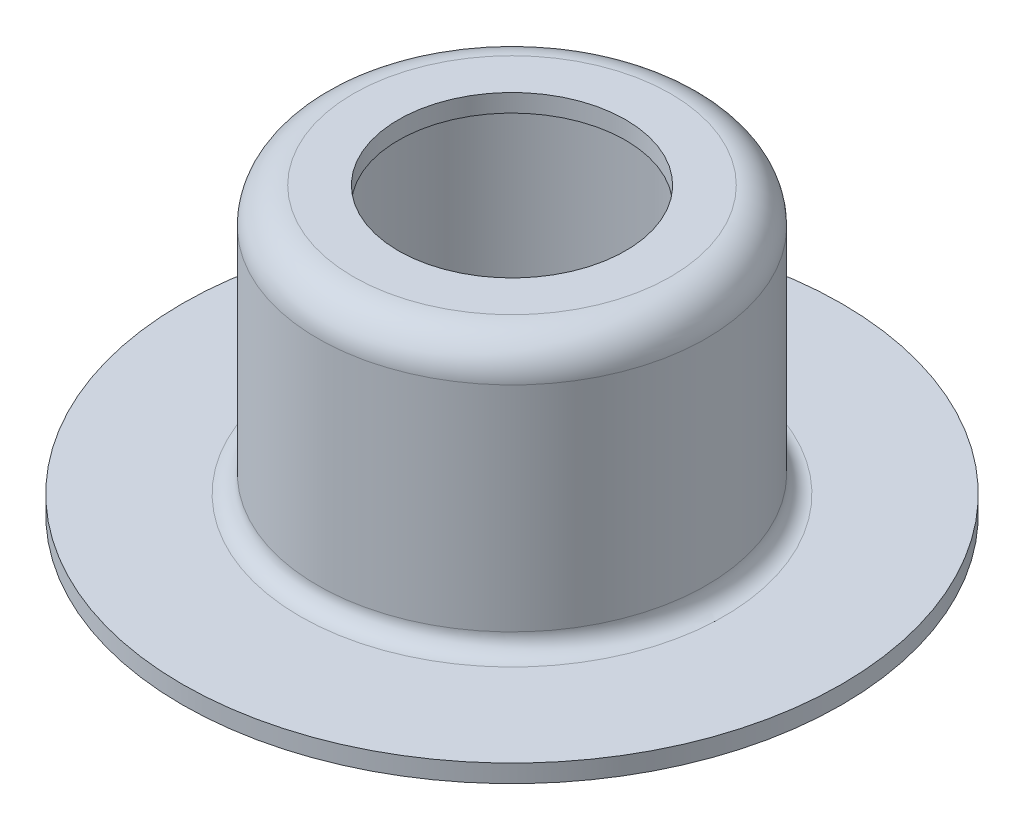
ISO-10303-21;
HEADER;
FILE_DESCRIPTION(('STEP AP214'),'2;1');
FILE_NAME('part.step','',(''),(''),'','','');
FILE_SCHEMA(('AUTOMOTIVE_DESIGN { 1 0 10303 214 1 1 1 1 }'));
ENDSEC;
DATA;
#1=APPLICATION_CONTEXT('core data for automotive mechanical design processes');
#2=APPLICATION_PROTOCOL_DEFINITION('international standard','automotive_design',2000,#1);
#3=PRODUCT_CONTEXT('',#1,'mechanical');
#4=PRODUCT('Part','Part','',(#3));
#5=PRODUCT_RELATED_PRODUCT_CATEGORY('part','',(#4));
#6=PRODUCT_DEFINITION_FORMATION('','',#4);
#7=PRODUCT_DEFINITION_CONTEXT('part definition',#1,'design');
#8=PRODUCT_DEFINITION('design','',#6,#7);
#9=PRODUCT_DEFINITION_SHAPE('','',#8);
#10=(LENGTH_UNIT() NAMED_UNIT(*) SI_UNIT(.MILLI.,.METRE.));
#11=(NAMED_UNIT(*) PLANE_ANGLE_UNIT() SI_UNIT($,.RADIAN.));
#12=(NAMED_UNIT(*) SI_UNIT($,.STERADIAN.) SOLID_ANGLE_UNIT());
#13=UNCERTAINTY_MEASURE_WITH_UNIT(LENGTH_MEASURE(1.E-05),#10,'distance_accuracy_value','');
#14=(GEOMETRIC_REPRESENTATION_CONTEXT(3) GLOBAL_UNCERTAINTY_ASSIGNED_CONTEXT((#13)) GLOBAL_UNIT_ASSIGNED_CONTEXT((#10,
#11,#12)) REPRESENTATION_CONTEXT('',''));
#15=CARTESIAN_POINT('',(0.,0.,0.));
#16=DIRECTION('',(0.,0.,1.));
#17=DIRECTION('',(1.,0.,0.));
#18=AXIS2_PLACEMENT_3D('',#15,#16,#17);
#19=CARTESIAN_POINT('',(0.,0.,0.));
#20=DIRECTION('',(0.,-1.,0.));
#21=DIRECTION('',(0.,0.,-1.));
#22=AXIS2_PLACEMENT_3D('',#19,#20,#21);
#23=CYLINDRICAL_SURFACE('',#22,18.5);
#24=CARTESIAN_POINT('',(0.,0.,0.));
#25=DIRECTION('',(0.,-1.,0.));
#26=DIRECTION('',(0.,0.,-1.));
#27=AXIS2_PLACEMENT_3D('',#24,#25,#26);
#28=CIRCLE('',#27,18.5);
#29=CARTESIAN_POINT('',(0.,0.,-18.5));
#30=VERTEX_POINT('',#29);
#31=EDGE_CURVE('E10',#30,#30,#28,.T.);
#32=ORIENTED_EDGE('',*,*,#31,.F.);
#33=EDGE_LOOP('',(#32));
#34=FACE_BOUND('',#33,.T.);
#35=CARTESIAN_POINT('',(0.,1.,0.));
#36=DIRECTION('',(0.,-1.,0.));
#37=DIRECTION('',(0.,0.,-1.));
#38=AXIS2_PLACEMENT_3D('',#35,#36,#37);
#39=CIRCLE('',#38,18.5);
#40=CARTESIAN_POINT('',(0.,1.,-18.5));
#41=VERTEX_POINT('',#40);
#42=EDGE_CURVE('E77',#41,#41,#39,.T.);
#43=ORIENTED_EDGE('',*,*,#42,.T.);
#44=EDGE_LOOP('',(#43));
#45=FACE_BOUND('',#44,.T.);
#46=ADVANCED_FACE('F37',(#34,#45),#23,.T.);
#47=CARTESIAN_POINT('',(-18.5,0.,0.));
#48=DIRECTION('',(0.,1.,0.));
#49=DIRECTION('',(0.,0.,1.));
#50=AXIS2_PLACEMENT_3D('',#47,#48,#49);
#51=PLANE('',#50);
#52=CARTESIAN_POINT('',(0.,0.,0.));
#53=DIRECTION('',(0.,-1.,0.));
#54=DIRECTION('',(0.,0.,-1.));
#55=AXIS2_PLACEMENT_3D('',#52,#53,#54);
#56=CIRCLE('',#55,10.9);
#57=CARTESIAN_POINT('',(0.,0.,-10.9));
#58=VERTEX_POINT('',#57);
#59=EDGE_CURVE('E43',#58,#58,#56,.T.);
#60=ORIENTED_EDGE('',*,*,#59,.F.);
#61=EDGE_LOOP('',(#60));
#62=FACE_BOUND('',#61,.T.);
#63=ORIENTED_EDGE('',*,*,#31,.T.);
#64=EDGE_LOOP('',(#63));
#65=FACE_BOUND('',#64,.T.);
#66=ADVANCED_FACE('F138',(#62,#65),#51,.F.);
#67=CARTESIAN_POINT('',(0.,2.,0.));
#68=DIRECTION('',(0.,-1.,0.));
#69=DIRECTION('',(0.,0.,-1.));
#70=AXIS2_PLACEMENT_3D('',#67,#68,#69);
#71=TOROIDAL_SURFACE('',#70,10.9,2.);
#72=CARTESIAN_POINT('',(0.,2.,0.));
#73=DIRECTION('',(0.,-1.,0.));
#74=DIRECTION('',(0.,0.,-1.));
#75=AXIS2_PLACEMENT_3D('',#72,#73,#74);
#76=CIRCLE('',#75,8.9);
#77=CARTESIAN_POINT('',(0.,2.,-8.9));
#78=VERTEX_POINT('',#77);
#79=EDGE_CURVE('E47',#78,#78,#76,.T.);
#80=ORIENTED_EDGE('',*,*,#79,.F.);
#81=EDGE_LOOP('',(#80));
#82=FACE_BOUND('',#81,.T.);
#83=ORIENTED_EDGE('',*,*,#59,.T.);
#84=EDGE_LOOP('',(#83));
#85=FACE_BOUND('',#84,.T.);
#86=ADVANCED_FACE('F133',(#82,#85),#71,.T.);
#87=CARTESIAN_POINT('',(0.,0.,0.));
#88=DIRECTION('',(0.,-1.,0.));
#89=DIRECTION('',(0.,0.,-1.));
#90=AXIS2_PLACEMENT_3D('',#87,#88,#89);
#91=CYLINDRICAL_SURFACE('',#90,8.9);
#92=CARTESIAN_POINT('',(0.,14.,0.));
#93=DIRECTION('',(0.,-1.,0.));
#94=DIRECTION('',(0.,0.,-1.));
#95=AXIS2_PLACEMENT_3D('',#92,#93,#94);
#96=CIRCLE('',#95,8.9);
#97=CARTESIAN_POINT('',(0.,14.,-8.9));
#98=VERTEX_POINT('',#97);
#99=EDGE_CURVE('E51',#98,#98,#96,.T.);
#100=ORIENTED_EDGE('',*,*,#99,.F.);
#101=EDGE_LOOP('',(#100));
#102=FACE_BOUND('',#101,.T.);
#103=ORIENTED_EDGE('',*,*,#79,.T.);
#104=EDGE_LOOP('',(#103));
#105=FACE_BOUND('',#104,.T.);
#106=ADVANCED_FACE('F127',(#102,#105),#91,.F.);
#107=CARTESIAN_POINT('',(0.,14.,0.));
#108=DIRECTION('',(0.,-1.,0.));
#109=DIRECTION('',(0.,0.,-1.));
#110=AXIS2_PLACEMENT_3D('',#107,#108,#109);
#111=TOROIDAL_SURFACE('',#110,7.9,1.);
#112=CARTESIAN_POINT('',(0.,15.,0.));
#113=DIRECTION('',(0.,-1.,0.));
#114=DIRECTION('',(0.,0.,-1.));
#115=AXIS2_PLACEMENT_3D('',#112,#113,#114);
#116=CIRCLE('',#115,7.9);
#117=CARTESIAN_POINT('',(0.,15.,-7.9));
#118=VERTEX_POINT('',#117);
#119=EDGE_CURVE('E56',#118,#118,#116,.T.);
#120=ORIENTED_EDGE('',*,*,#119,.F.);
#121=EDGE_LOOP('',(#120));
#122=FACE_BOUND('',#121,.T.);
#123=ORIENTED_EDGE('',*,*,#99,.T.);
#124=EDGE_LOOP('',(#123));
#125=FACE_BOUND('',#124,.T.);
#126=ADVANCED_FACE('F121',(#122,#125),#111,.F.);
#127=CARTESIAN_POINT('',(-7.9,15.,0.));
#128=DIRECTION('',(0.,1.,0.));
#129=DIRECTION('',(0.,0.,1.));
#130=AXIS2_PLACEMENT_3D('',#127,#128,#129);
#131=PLANE('',#130);
#132=CARTESIAN_POINT('',(0.,15.,0.));
#133=DIRECTION('',(0.,-1.,0.));
#134=DIRECTION('',(0.,0.,-1.));
#135=AXIS2_PLACEMENT_3D('',#132,#133,#134);
#136=CIRCLE('',#135,6.375);
#137=CARTESIAN_POINT('',(0.,15.,-6.375));
#138=VERTEX_POINT('',#137);
#139=EDGE_CURVE('E59',#138,#138,#136,.T.);
#140=ORIENTED_EDGE('',*,*,#139,.F.);
#141=EDGE_LOOP('',(#140));
#142=FACE_BOUND('',#141,.T.);
#143=ORIENTED_EDGE('',*,*,#119,.T.);
#144=EDGE_LOOP('',(#143));
#145=FACE_BOUND('',#144,.T.);
#146=ADVANCED_FACE('F115',(#142,#145),#131,.F.);
#147=CARTESIAN_POINT('',(0.,0.,0.));
#148=DIRECTION('',(0.,-1.,0.));
#149=DIRECTION('',(0.,0.,-1.));
#150=AXIS2_PLACEMENT_3D('',#147,#148,#149);
#151=CYLINDRICAL_SURFACE('',#150,6.375);
#152=CARTESIAN_POINT('',(0.,16.,0.));
#153=DIRECTION('',(0.,-1.,0.));
#154=DIRECTION('',(0.,0.,-1.));
#155=AXIS2_PLACEMENT_3D('',#152,#153,#154);
#156=CIRCLE('',#155,6.375);
#157=CARTESIAN_POINT('',(0.,16.,-6.375));
#158=VERTEX_POINT('',#157);
#159=EDGE_CURVE('E62',#158,#158,#156,.T.);
#160=ORIENTED_EDGE('',*,*,#159,.F.);
#161=EDGE_LOOP('',(#160));
#162=FACE_BOUND('',#161,.T.);
#163=ORIENTED_EDGE('',*,*,#139,.T.);
#164=EDGE_LOOP('',(#163));
#165=FACE_BOUND('',#164,.T.);
#166=ADVANCED_FACE('F109',(#162,#165),#151,.F.);
#167=CARTESIAN_POINT('',(-6.375,16.,0.));
#168=DIRECTION('',(0.,-1.,0.));
#169=DIRECTION('',(0.,0.,-1.));
#170=AXIS2_PLACEMENT_3D('',#167,#168,#169);
#171=PLANE('',#170);
#172=CARTESIAN_POINT('',(0.,16.,0.));
#173=DIRECTION('',(0.,-1.,0.));
#174=DIRECTION('',(0.,0.,-1.));
#175=AXIS2_PLACEMENT_3D('',#172,#173,#174);
#176=CIRCLE('',#175,8.9);
#177=CARTESIAN_POINT('',(0.,16.,-8.9));
#178=VERTEX_POINT('',#177);
#179=EDGE_CURVE('E65',#178,#178,#176,.T.);
#180=ORIENTED_EDGE('',*,*,#179,.F.);
#181=EDGE_LOOP('',(#180));
#182=FACE_BOUND('',#181,.T.);
#183=ORIENTED_EDGE('',*,*,#159,.T.);
#184=EDGE_LOOP('',(#183));
#185=FACE_BOUND('',#184,.T.);
#186=ADVANCED_FACE('F103',(#182,#185),#171,.F.);
#187=CARTESIAN_POINT('',(0.,14.,0.));
#188=DIRECTION('',(0.,-1.,0.));
#189=DIRECTION('',(0.,0.,-1.));
#190=AXIS2_PLACEMENT_3D('',#187,#188,#189);
#191=TOROIDAL_SURFACE('',#190,8.9,2.);
#192=CARTESIAN_POINT('',(0.,14.,0.));
#193=DIRECTION('',(0.,-1.,0.));
#194=DIRECTION('',(0.,0.,-1.));
#195=AXIS2_PLACEMENT_3D('',#192,#193,#194);
#196=CIRCLE('',#195,10.9);
#197=CARTESIAN_POINT('',(0.,14.,-10.9));
#198=VERTEX_POINT('',#197);
#199=EDGE_CURVE('E68',#198,#198,#196,.T.);
#200=ORIENTED_EDGE('',*,*,#199,.F.);
#201=EDGE_LOOP('',(#200));
#202=FACE_BOUND('',#201,.T.);
#203=ORIENTED_EDGE('',*,*,#179,.T.);
#204=EDGE_LOOP('',(#203));
#205=FACE_BOUND('',#204,.T.);
#206=ADVANCED_FACE('F97',(#202,#205),#191,.T.);
#207=CARTESIAN_POINT('',(0.,0.,0.));
#208=DIRECTION('',(0.,-1.,0.));
#209=DIRECTION('',(0.,0.,-1.));
#210=AXIS2_PLACEMENT_3D('',#207,#208,#209);
#211=CYLINDRICAL_SURFACE('',#210,10.9);
#212=CARTESIAN_POINT('',(0.,2.00000000000001,0.));
#213=DIRECTION('',(0.,-1.,0.));
#214=DIRECTION('',(0.,0.,-1.));
#215=AXIS2_PLACEMENT_3D('',#212,#213,#214);
#216=CIRCLE('',#215,10.9);
#217=CARTESIAN_POINT('',(0.,2.00000000000001,-10.9));
#218=VERTEX_POINT('',#217);
#219=EDGE_CURVE('E71',#218,#218,#216,.T.);
#220=ORIENTED_EDGE('',*,*,#219,.F.);
#221=EDGE_LOOP('',(#220));
#222=FACE_BOUND('',#221,.T.);
#223=ORIENTED_EDGE('',*,*,#199,.T.);
#224=EDGE_LOOP('',(#223));
#225=FACE_BOUND('',#224,.T.);
#226=ADVANCED_FACE('F91',(#222,#225),#211,.T.);
#227=CARTESIAN_POINT('',(0.,2.,0.));
#228=DIRECTION('',(0.,-1.,0.));
#229=DIRECTION('',(0.,0.,-1.));
#230=AXIS2_PLACEMENT_3D('',#227,#228,#229);
#231=TOROIDAL_SURFACE('',#230,11.9,1.);
#232=CARTESIAN_POINT('',(0.,1.,0.));
#233=DIRECTION('',(0.,-1.,0.));
#234=DIRECTION('',(0.,0.,-1.));
#235=AXIS2_PLACEMENT_3D('',#232,#233,#234);
#236=CIRCLE('',#235,11.9);
#237=CARTESIAN_POINT('',(0.,1.,-11.9));
#238=VERTEX_POINT('',#237);
#239=EDGE_CURVE('E74',#238,#238,#236,.T.);
#240=ORIENTED_EDGE('',*,*,#239,.F.);
#241=EDGE_LOOP('',(#240));
#242=FACE_BOUND('',#241,.T.);
#243=ORIENTED_EDGE('',*,*,#219,.T.);
#244=EDGE_LOOP('',(#243));
#245=FACE_BOUND('',#244,.T.);
#246=ADVANCED_FACE('F85',(#242,#245),#231,.F.);
#247=CARTESIAN_POINT('',(-11.9,1.,0.));
#248=DIRECTION('',(0.,-1.,0.));
#249=DIRECTION('',(0.,0.,-1.));
#250=AXIS2_PLACEMENT_3D('',#247,#248,#249);
#251=PLANE('',#250);
#252=ORIENTED_EDGE('',*,*,#42,.F.);
#253=EDGE_LOOP('',(#252));
#254=FACE_BOUND('',#253,.T.);
#255=ORIENTED_EDGE('',*,*,#239,.T.);
#256=EDGE_LOOP('',(#255));
#257=FACE_BOUND('',#256,.T.);
#258=ADVANCED_FACE('F82',(#254,#257),#251,.F.);
#259=CLOSED_SHELL('',(#46,#66,#86,#106,#126,#146,#166,#186,#206,#226,#246,#258));
#260=MANIFOLD_SOLID_BREP('B2',#259);
#261=ADVANCED_BREP_SHAPE_REPRESENTATION('',(#18,#260),#14);
#262=SHAPE_DEFINITION_REPRESENTATION(#9,#261);
ENDSEC;
END-ISO-10303-21;
